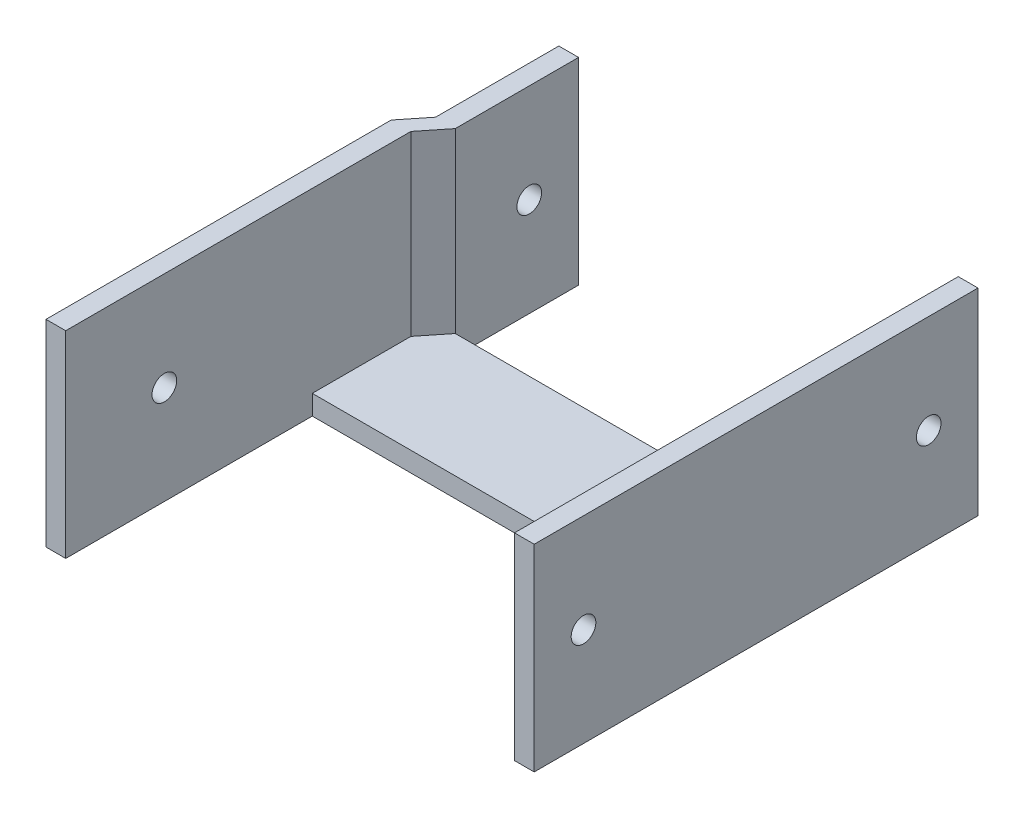
ISO-10303-21;
HEADER;
FILE_DESCRIPTION(('STEP AP214'),'2;1');
FILE_NAME('part.step','',(''),(''),'','','');
FILE_SCHEMA(('AUTOMOTIVE_DESIGN { 1 0 10303 214 1 1 1 1 }'));
ENDSEC;
DATA;
#1=APPLICATION_CONTEXT('core data for automotive mechanical design processes');
#2=APPLICATION_PROTOCOL_DEFINITION('international standard','automotive_design',2000,#1);
#3=PRODUCT_CONTEXT('',#1,'mechanical');
#4=PRODUCT('Part','Part','',(#3));
#5=PRODUCT_RELATED_PRODUCT_CATEGORY('part','',(#4));
#6=PRODUCT_DEFINITION_FORMATION('','',#4);
#7=PRODUCT_DEFINITION_CONTEXT('part definition',#1,'design');
#8=PRODUCT_DEFINITION('design','',#6,#7);
#9=PRODUCT_DEFINITION_SHAPE('','',#8);
#10=(LENGTH_UNIT() NAMED_UNIT(*) SI_UNIT(.MILLI.,.METRE.));
#11=(NAMED_UNIT(*) PLANE_ANGLE_UNIT() SI_UNIT($,.RADIAN.));
#12=(NAMED_UNIT(*) SI_UNIT($,.STERADIAN.) SOLID_ANGLE_UNIT());
#13=UNCERTAINTY_MEASURE_WITH_UNIT(LENGTH_MEASURE(1.E-05),#10,'distance_accuracy_value','');
#14=(GEOMETRIC_REPRESENTATION_CONTEXT(3) GLOBAL_UNCERTAINTY_ASSIGNED_CONTEXT((#13)) GLOBAL_UNIT_ASSIGNED_CONTEXT((#10,
#11,#12)) REPRESENTATION_CONTEXT('',''));
#15=CARTESIAN_POINT('',(0.,0.,0.));
#16=DIRECTION('',(0.,0.,1.));
#17=DIRECTION('',(1.,0.,0.));
#18=AXIS2_PLACEMENT_3D('',#15,#16,#17);
#19=CARTESIAN_POINT('',(-37.981426306344,-30.,0.));
#20=DIRECTION('',(-1.,0.,0.));
#21=DIRECTION('',(0.,0.,1.));
#22=AXIS2_PLACEMENT_3D('',#19,#20,#21);
#23=PLANE('',#22);
#24=DIRECTION('',(0.,1.,0.));
#25=VECTOR('',#24,1.);
#26=CARTESIAN_POINT('',(-37.981426306344,40.,4.99999999999999));
#27=LINE('',#26,#25);
#28=CARTESIAN_POINT('',(-37.981426306344,0.,4.99999999999999));
#29=VERTEX_POINT('',#28);
#30=CARTESIAN_POINT('',(-37.981426306344,40.,4.99999999999999));
#31=VERTEX_POINT('',#30);
#32=EDGE_CURVE('E150',#29,#31,#27,.T.);
#33=ORIENTED_EDGE('',*,*,#32,.F.);
#34=DIRECTION('',(0.,0.,1.));
#35=VECTOR('',#34,1.);
#36=CARTESIAN_POINT('',(-37.981426306344,0.,105.));
#37=LINE('',#36,#35);
#38=CARTESIAN_POINT('',(-37.981426306344,0.,30.));
#39=VERTEX_POINT('',#38);
#40=EDGE_CURVE('E159',#29,#39,#37,.T.);
#41=ORIENTED_EDGE('',*,*,#40,.T.);
#42=DIRECTION('',(0.,1.,0.));
#43=VECTOR('',#42,1.);
#44=CARTESIAN_POINT('',(-37.981426306344,-30.,30.));
#45=LINE('',#44,#43);
#46=CARTESIAN_POINT('',(-37.981426306344,40.,30.));
#47=VERTEX_POINT('',#46);
#48=EDGE_CURVE('E186',#39,#47,#45,.T.);
#49=ORIENTED_EDGE('',*,*,#48,.T.);
#50=DIRECTION('',(0.,0.,1.));
#51=VECTOR('',#50,1.);
#52=CARTESIAN_POINT('',(-37.981426306344,40.,0.));
#53=LINE('',#52,#51);
#54=EDGE_CURVE('E161',#31,#47,#53,.T.);
#55=ORIENTED_EDGE('',*,*,#54,.F.);
#56=EDGE_LOOP('',(#33,#41,#49,#55));
#57=FACE_BOUND('',#56,.T.);
#58=CARTESIAN_POINT('',(-37.981426306344,20.,15.));
#59=DIRECTION('',(-1.,0.,0.));
#60=DIRECTION('',(0.,0.,1.));
#61=AXIS2_PLACEMENT_3D('',#58,#59,#60);
#62=CIRCLE('',#61,2.5);
#63=CARTESIAN_POINT('',(-37.981426306344,20.,17.5));
#64=VERTEX_POINT('',#63);
#65=EDGE_CURVE('E337',#64,#64,#62,.T.);
#66=ORIENTED_EDGE('',*,*,#65,.F.);
#67=EDGE_LOOP('',(#66));
#68=FACE_BOUND('',#67,.T.);
#69=ADVANCED_FACE('F41',(#57,#68),#23,.T.);
#70=CARTESIAN_POINT('',(-33.981426306344,40.,30.));
#71=DIRECTION('',(-1.,0.,0.));
#72=DIRECTION('',(0.,0.,1.));
#73=AXIS2_PLACEMENT_3D('',#70,#71,#72);
#74=PLANE('',#73);
#75=CARTESIAN_POINT('',(-33.981426306344,20.,15.));
#76=DIRECTION('',(-1.,0.,0.));
#77=DIRECTION('',(0.,0.,1.));
#78=AXIS2_PLACEMENT_3D('',#75,#76,#77);
#79=CIRCLE('',#78,2.5);
#80=CARTESIAN_POINT('',(-33.981426306344,20.,17.5));
#81=VERTEX_POINT('',#80);
#82=EDGE_CURVE('E343',#81,#81,#79,.T.);
#83=ORIENTED_EDGE('',*,*,#82,.T.);
#84=EDGE_LOOP('',(#83));
#85=FACE_BOUND('',#84,.T.);
#86=DIRECTION('',(0.,0.,1.));
#87=VECTOR('',#86,1.);
#88=CARTESIAN_POINT('',(-33.981426306344,0.,105.));
#89=LINE('',#88,#87);
#90=CARTESIAN_POINT('',(-33.981426306344,0.,4.99999999999999));
#91=VERTEX_POINT('',#90);
#92=CARTESIAN_POINT('',(-33.981426306344,0.,30.));
#93=VERTEX_POINT('',#92);
#94=EDGE_CURVE('E267',#91,#93,#89,.T.);
#95=ORIENTED_EDGE('',*,*,#94,.F.);
#96=DIRECTION('',(0.,1.,0.));
#97=VECTOR('',#96,1.);
#98=CARTESIAN_POINT('',(-33.981426306344,40.,4.99999999999999));
#99=LINE('',#98,#97);
#100=CARTESIAN_POINT('',(-33.981426306344,40.,4.99999999999999));
#101=VERTEX_POINT('',#100);
#102=EDGE_CURVE('E56',#91,#101,#99,.T.);
#103=ORIENTED_EDGE('',*,*,#102,.T.);
#104=DIRECTION('',(0.,0.,-1.));
#105=VECTOR('',#104,1.);
#106=CARTESIAN_POINT('',(-33.981426306344,40.,30.));
#107=LINE('',#106,#105);
#108=CARTESIAN_POINT('',(-33.981426306344,40.,30.));
#109=VERTEX_POINT('',#108);
#110=EDGE_CURVE('E207',#109,#101,#107,.T.);
#111=ORIENTED_EDGE('',*,*,#110,.F.);
#112=DIRECTION('',(0.,1.,0.));
#113=VECTOR('',#112,1.);
#114=CARTESIAN_POINT('',(-33.981426306344,40.,30.));
#115=LINE('',#114,#113);
#116=CARTESIAN_POINT('',(-33.981426306344,4.,30.));
#117=VERTEX_POINT('',#116);
#118=EDGE_CURVE('E203',#117,#109,#115,.T.);
#119=ORIENTED_EDGE('',*,*,#118,.F.);
#120=DIRECTION('',(0.,1.,0.));
#121=VECTOR('',#120,1.);
#122=CARTESIAN_POINT('',(-33.981426306344,-26.,30.));
#123=LINE('',#122,#121);
#124=EDGE_CURVE('E254',#93,#117,#123,.T.);
#125=ORIENTED_EDGE('',*,*,#124,.F.);
#126=EDGE_LOOP('',(#95,#103,#111,#119,#125));
#127=FACE_BOUND('',#126,.T.);
#128=ADVANCED_FACE('F377',(#85,#127),#74,.F.);
#129=CARTESIAN_POINT('',(0.,40.,105.));
#130=DIRECTION('',(0.,1.,0.));
#131=DIRECTION('',(0.,0.,1.));
#132=AXIS2_PLACEMENT_3D('',#129,#130,#131);
#133=PLANE('',#132);
#134=DIRECTION('',(-1.,0.,0.));
#135=VECTOR('',#134,1.);
#136=CARTESIAN_POINT('',(-27.981426306344,40.,4.99999999999999));
#137=LINE('',#136,#135);
#138=EDGE_CURVE('E163',#101,#31,#137,.T.);
#139=ORIENTED_EDGE('',*,*,#138,.T.);
#140=ORIENTED_EDGE('',*,*,#54,.T.);
#141=DIRECTION('',(0.624695047554425,0.,-0.78086880944303));
#142=VECTOR('',#141,1.);
#143=CARTESIAN_POINT('',(-8.52525994289262,40.,-6.82020795431412));
#144=LINE('',#143,#142);
#145=CARTESIAN_POINT('',(-41.981426306344,40.,35.));
#146=VERTEX_POINT('',#145);
#147=EDGE_CURVE('E175',#146,#47,#144,.T.);
#148=ORIENTED_EDGE('',*,*,#147,.F.);
#149=DIRECTION('',(0.,0.,-1.));
#150=VECTOR('',#149,1.);
#151=CARTESIAN_POINT('',(-41.981426306344,40.,105.));
#152=LINE('',#151,#150);
#153=CARTESIAN_POINT('',(-41.981426306344,40.,105.));
#154=VERTEX_POINT('',#153);
#155=EDGE_CURVE('E245',#154,#146,#152,.T.);
#156=ORIENTED_EDGE('',*,*,#155,.F.);
#157=DIRECTION('',(1.,0.,0.));
#158=VECTOR('',#157,1.);
#159=CARTESIAN_POINT('',(0.,40.,105.));
#160=LINE('',#159,#158);
#161=CARTESIAN_POINT('',(-37.981426306344,40.,105.));
#162=VERTEX_POINT('',#161);
#163=EDGE_CURVE('E244',#154,#162,#160,.T.);
#164=ORIENTED_EDGE('',*,*,#163,.T.);
#165=DIRECTION('',(0.,0.,-1.));
#166=VECTOR('',#165,1.);
#167=CARTESIAN_POINT('',(-37.981426306344,40.,105.));
#168=LINE('',#167,#166);
#169=CARTESIAN_POINT('',(-37.981426306344,40.,35.));
#170=VERTEX_POINT('',#169);
#171=EDGE_CURVE('E240',#162,#170,#168,.T.);
#172=ORIENTED_EDGE('',*,*,#171,.T.);
#173=DIRECTION('',(0.624695047554424,0.,-0.78086880944303));
#174=VECTOR('',#173,1.);
#175=CARTESIAN_POINT('',(-33.981426306344,40.,30.));
#176=LINE('',#175,#174);
#177=EDGE_CURVE('E193',#170,#109,#176,.T.);
#178=ORIENTED_EDGE('',*,*,#177,.T.);
#179=ORIENTED_EDGE('',*,*,#110,.T.);
#180=EDGE_LOOP('',(#139,#140,#148,#156,#164,#172,#178,#179));
#181=FACE_BOUND('',#180,.T.);
#182=ADVANCED_FACE('F43',(#181),#133,.T.);
#183=CARTESIAN_POINT('',(-33.981426306344,0.,30.));
#184=DIRECTION('',(0.78086880944303,0.,0.624695047554424));
#185=DIRECTION('',(0.624695047554424,0.,-0.78086880944303));
#186=AXIS2_PLACEMENT_3D('',#183,#184,#185);
#187=PLANE('',#186);
#188=DIRECTION('',(-0.624695047554424,0.,0.78086880944303));
#189=VECTOR('',#188,1.);
#190=CARTESIAN_POINT('',(-33.981426306344,4.,30.));
#191=LINE('',#190,#189);
#192=CARTESIAN_POINT('',(-37.981426306344,4.,35.0000000000001));
#193=VERTEX_POINT('',#192);
#194=EDGE_CURVE('E50',#117,#193,#191,.T.);
#195=ORIENTED_EDGE('',*,*,#194,.F.);
#196=ORIENTED_EDGE('',*,*,#118,.T.);
#197=ORIENTED_EDGE('',*,*,#177,.F.);
#198=DIRECTION('',(0.,1.,0.));
#199=VECTOR('',#198,1.);
#200=CARTESIAN_POINT('',(-37.981426306344,0.,35.));
#201=LINE('',#200,#199);
#202=EDGE_CURVE('E197',#193,#170,#201,.T.);
#203=ORIENTED_EDGE('',*,*,#202,.F.);
#204=EDGE_LOOP('',(#195,#196,#197,#203));
#205=FACE_BOUND('',#204,.T.);
#206=ADVANCED_FACE('F402',(#205),#187,.T.);
#207=CARTESIAN_POINT('',(0.,0.,105.));
#208=DIRECTION('',(0.,0.,1.));
#209=DIRECTION('',(1.,0.,0.));
#210=AXIS2_PLACEMENT_3D('',#207,#208,#209);
#211=PLANE('',#210);
#212=DIRECTION('',(1.,0.,0.));
#213=VECTOR('',#212,1.);
#214=CARTESIAN_POINT('',(0.,0.,105.));
#215=LINE('',#214,#213);
#216=CARTESIAN_POINT('',(-41.981426306344,0.,105.));
#217=VERTEX_POINT('',#216);
#218=CARTESIAN_POINT('',(-37.981426306344,0.,105.));
#219=VERTEX_POINT('',#218);
#220=EDGE_CURVE('E183',#217,#219,#215,.T.);
#221=ORIENTED_EDGE('',*,*,#220,.T.);
#222=DIRECTION('',(0.,-1.,0.));
#223=VECTOR('',#222,1.);
#224=CARTESIAN_POINT('',(-37.981426306344,0.,105.));
#225=LINE('',#224,#223);
#226=EDGE_CURVE('E189',#162,#219,#225,.T.);
#227=ORIENTED_EDGE('',*,*,#226,.F.);
#228=ORIENTED_EDGE('',*,*,#163,.F.);
#229=DIRECTION('',(0.,1.,0.));
#230=VECTOR('',#229,1.);
#231=CARTESIAN_POINT('',(-41.981426306344,0.,105.));
#232=LINE('',#231,#230);
#233=EDGE_CURVE('E243',#217,#154,#232,.T.);
#234=ORIENTED_EDGE('',*,*,#233,.F.);
#235=EDGE_LOOP('',(#221,#227,#228,#234));
#236=FACE_BOUND('',#235,.T.);
#237=ADVANCED_FACE('F405',(#236),#211,.T.);
#238=CARTESIAN_POINT('',(-37.981426306344,0.,105.));
#239=DIRECTION('',(1.,0.,0.));
#240=DIRECTION('',(0.,1.,0.));
#241=AXIS2_PLACEMENT_3D('',#238,#239,#240);
#242=PLANE('',#241);
#243=CARTESIAN_POINT('',(-37.981426306344,20.,85.));
#244=DIRECTION('',(1.,0.,0.));
#245=DIRECTION('',(0.,1.,0.));
#246=AXIS2_PLACEMENT_3D('',#243,#244,#245);
#247=CIRCLE('',#246,2.5);
#248=CARTESIAN_POINT('',(-37.981426306344,22.5,85.));
#249=VERTEX_POINT('',#248);
#250=EDGE_CURVE('E351',#249,#249,#247,.T.);
#251=ORIENTED_EDGE('',*,*,#250,.F.);
#252=EDGE_LOOP('',(#251));
#253=FACE_BOUND('',#252,.T.);
#254=DIRECTION('',(0.,0.,-1.));
#255=VECTOR('',#254,1.);
#256=CARTESIAN_POINT('',(-37.981426306344,4.,105.));
#257=LINE('',#256,#255);
#258=CARTESIAN_POINT('',(-37.981426306344,4.,55.));
#259=VERTEX_POINT('',#258);
#260=EDGE_CURVE('E219',#259,#193,#257,.T.);
#261=ORIENTED_EDGE('',*,*,#260,.T.);
#262=ORIENTED_EDGE('',*,*,#202,.T.);
#263=ORIENTED_EDGE('',*,*,#171,.F.);
#264=ORIENTED_EDGE('',*,*,#226,.T.);
#265=DIRECTION('',(0.,0.,1.));
#266=VECTOR('',#265,1.);
#267=CARTESIAN_POINT('',(-37.981426306344,0.,105.));
#268=LINE('',#267,#266);
#269=CARTESIAN_POINT('',(-37.981426306344,0.,55.));
#270=VERTEX_POINT('',#269);
#271=EDGE_CURVE('E252',#270,#219,#268,.T.);
#272=ORIENTED_EDGE('',*,*,#271,.F.);
#273=DIRECTION('',(0.,1.,0.));
#274=VECTOR('',#273,1.);
#275=CARTESIAN_POINT('',(-37.981426306344,-26.,55.));
#276=LINE('',#275,#274);
#277=EDGE_CURVE('E228',#270,#259,#276,.T.);
#278=ORIENTED_EDGE('',*,*,#277,.T.);
#279=EDGE_LOOP('',(#261,#262,#263,#264,#272,#278));
#280=FACE_BOUND('',#279,.T.);
#281=ADVANCED_FACE('F225',(#253,#280),#242,.T.);
#282=CARTESIAN_POINT('',(0.,40.,105.));
#283=DIRECTION('',(0.,-1.,0.));
#284=DIRECTION('',(0.,0.,-1.));
#285=AXIS2_PLACEMENT_3D('',#282,#283,#284);
#286=PLANE('',#285);
#287=DIRECTION('',(0.,0.,-1.));
#288=VECTOR('',#287,1.);
#289=CARTESIAN_POINT('',(43.018573693656,40.,105.));
#290=LINE('',#289,#288);
#291=CARTESIAN_POINT('',(43.018573693656,40.,95.));
#292=VERTEX_POINT('',#291);
#293=CARTESIAN_POINT('',(43.018573693656,40.,4.99999999999999));
#294=VERTEX_POINT('',#293);
#295=EDGE_CURVE('E282',#292,#294,#290,.T.);
#296=ORIENTED_EDGE('',*,*,#295,.F.);
#297=DIRECTION('',(1.,0.,0.));
#298=VECTOR('',#297,1.);
#299=CARTESIAN_POINT('',(43.018573693656,40.,95.));
#300=LINE('',#299,#298);
#301=CARTESIAN_POINT('',(47.018573693656,40.,95.));
#302=VERTEX_POINT('',#301);
#303=EDGE_CURVE('E325',#292,#302,#300,.T.);
#304=ORIENTED_EDGE('',*,*,#303,.T.);
#305=DIRECTION('',(0.,0.,-1.));
#306=VECTOR('',#305,1.);
#307=CARTESIAN_POINT('',(47.018573693656,40.,105.));
#308=LINE('',#307,#306);
#309=CARTESIAN_POINT('',(47.018573693656,40.,4.99999999999999));
#310=VERTEX_POINT('',#309);
#311=EDGE_CURVE('E230',#302,#310,#308,.T.);
#312=ORIENTED_EDGE('',*,*,#311,.T.);
#313=DIRECTION('',(1.,0.,0.));
#314=VECTOR('',#313,1.);
#315=CARTESIAN_POINT('',(43.018573693656,40.,4.99999999999999));
#316=LINE('',#315,#314);
#317=EDGE_CURVE('E313',#294,#310,#316,.T.);
#318=ORIENTED_EDGE('',*,*,#317,.F.);
#319=EDGE_LOOP('',(#296,#304,#312,#318));
#320=FACE_BOUND('',#319,.T.);
#321=ADVANCED_FACE('F423',(#320),#286,.F.);
#322=CARTESIAN_POINT('',(43.018573693656,0.,105.));
#323=DIRECTION('',(1.,0.,0.));
#324=DIRECTION('',(0.,1.,0.));
#325=AXIS2_PLACEMENT_3D('',#322,#323,#324);
#326=PLANE('',#325);
#327=CARTESIAN_POINT('',(43.018573693656,20.,15.));
#328=DIRECTION('',(1.,0.,0.));
#329=DIRECTION('',(0.,1.,0.));
#330=AXIS2_PLACEMENT_3D('',#327,#328,#329);
#331=CIRCLE('',#330,2.5);
#332=CARTESIAN_POINT('',(43.018573693656,22.5,15.));
#333=VERTEX_POINT('',#332);
#334=EDGE_CURVE('E347',#333,#333,#331,.T.);
#335=ORIENTED_EDGE('',*,*,#334,.T.);
#336=EDGE_LOOP('',(#335));
#337=FACE_BOUND('',#336,.T.);
#338=CARTESIAN_POINT('',(43.018573693656,20.,85.));
#339=DIRECTION('',(1.,0.,0.));
#340=DIRECTION('',(0.,1.,0.));
#341=AXIS2_PLACEMENT_3D('',#338,#339,#340);
#342=CIRCLE('',#341,2.5);
#343=CARTESIAN_POINT('',(43.018573693656,22.5,85.));
#344=VERTEX_POINT('',#343);
#345=EDGE_CURVE('E355',#344,#344,#342,.T.);
#346=ORIENTED_EDGE('',*,*,#345,.T.);
#347=EDGE_LOOP('',(#346));
#348=FACE_BOUND('',#347,.T.);
#349=DIRECTION('',(0.,0.,-1.));
#350=VECTOR('',#349,1.);
#351=CARTESIAN_POINT('',(43.018573693656,0.,105.));
#352=LINE('',#351,#350);
#353=CARTESIAN_POINT('',(43.018573693656,0.,95.));
#354=VERTEX_POINT('',#353);
#355=CARTESIAN_POINT('',(43.018573693656,0.,55.));
#356=VERTEX_POINT('',#355);
#357=EDGE_CURVE('E276',#354,#356,#352,.T.);
#358=ORIENTED_EDGE('',*,*,#357,.F.);
#359=DIRECTION('',(0.,1.,0.));
#360=VECTOR('',#359,1.);
#361=CARTESIAN_POINT('',(43.018573693656,0.,95.));
#362=LINE('',#361,#360);
#363=EDGE_CURVE('E64',#354,#292,#362,.T.);
#364=ORIENTED_EDGE('',*,*,#363,.T.);
#365=ORIENTED_EDGE('',*,*,#295,.T.);
#366=DIRECTION('',(0.,-1.,0.));
#367=VECTOR('',#366,1.);
#368=CARTESIAN_POINT('',(43.018573693656,40.,4.99999999999999));
#369=LINE('',#368,#367);
#370=CARTESIAN_POINT('',(43.018573693656,0.,4.99999999999999));
#371=VERTEX_POINT('',#370);
#372=EDGE_CURVE('E317',#294,#371,#369,.T.);
#373=ORIENTED_EDGE('',*,*,#372,.T.);
#374=DIRECTION('',(0.,0.,-1.));
#375=VECTOR('',#374,1.);
#376=CARTESIAN_POINT('',(43.018573693656,0.,105.));
#377=LINE('',#376,#375);
#378=CARTESIAN_POINT('',(43.018573693656,0.,30.));
#379=VERTEX_POINT('',#378);
#380=EDGE_CURVE('E272',#379,#371,#377,.T.);
#381=ORIENTED_EDGE('',*,*,#380,.F.);
#382=DIRECTION('',(0.,1.,0.));
#383=VECTOR('',#382,1.);
#384=CARTESIAN_POINT('',(43.018573693656,-26.,30.));
#385=LINE('',#384,#383);
#386=CARTESIAN_POINT('',(43.018573693656,3.99999999999999,30.));
#387=VERTEX_POINT('',#386);
#388=EDGE_CURVE('E234',#379,#387,#385,.T.);
#389=ORIENTED_EDGE('',*,*,#388,.T.);
#390=DIRECTION('',(0.,0.,-1.));
#391=VECTOR('',#390,1.);
#392=CARTESIAN_POINT('',(43.018573693656,4.,105.));
#393=LINE('',#392,#391);
#394=CARTESIAN_POINT('',(43.018573693656,3.99999999999999,55.));
#395=VERTEX_POINT('',#394);
#396=EDGE_CURVE('E238',#395,#387,#393,.T.);
#397=ORIENTED_EDGE('',*,*,#396,.F.);
#398=DIRECTION('',(0.,1.,0.));
#399=VECTOR('',#398,1.);
#400=CARTESIAN_POINT('',(43.018573693656,-26.,55.));
#401=LINE('',#400,#399);
#402=EDGE_CURVE('E178',#356,#395,#401,.T.);
#403=ORIENTED_EDGE('',*,*,#402,.F.);
#404=EDGE_LOOP('',(#358,#364,#365,#373,#381,#389,#397,#403));
#405=FACE_BOUND('',#404,.T.);
#406=ADVANCED_FACE('F300',(#337,#348,#405),#326,.F.);
#407=CARTESIAN_POINT('',(0.,4.,105.));
#408=DIRECTION('',(0.,1.,0.));
#409=DIRECTION('',(0.,0.,1.));
#410=AXIS2_PLACEMENT_3D('',#407,#408,#409);
#411=PLANE('',#410);
#412=DIRECTION('',(1.,0.,0.));
#413=VECTOR('',#412,1.);
#414=CARTESIAN_POINT('',(-33.981426306344,4.,30.));
#415=LINE('',#414,#413);
#416=EDGE_CURVE('E221',#117,#387,#415,.T.);
#417=ORIENTED_EDGE('',*,*,#416,.F.);
#418=ORIENTED_EDGE('',*,*,#194,.T.);
#419=ORIENTED_EDGE('',*,*,#260,.F.);
#420=DIRECTION('',(-1.,0.,0.));
#421=VECTOR('',#420,1.);
#422=CARTESIAN_POINT('',(-37.981426306344,4.,55.));
#423=LINE('',#422,#421);
#424=EDGE_CURVE('E171',#395,#259,#423,.T.);
#425=ORIENTED_EDGE('',*,*,#424,.F.);
#426=ORIENTED_EDGE('',*,*,#396,.T.);
#427=EDGE_LOOP('',(#417,#418,#419,#425,#426));
#428=FACE_BOUND('',#427,.T.);
#429=ADVANCED_FACE('F217',(#428),#411,.T.);
#430=CARTESIAN_POINT('',(-41.981426306344,0.,105.));
#431=DIRECTION('',(-1.,0.,0.));
#432=DIRECTION('',(0.,0.,1.));
#433=AXIS2_PLACEMENT_3D('',#430,#431,#432);
#434=PLANE('',#433);
#435=CARTESIAN_POINT('',(-41.981426306344,20.,85.));
#436=DIRECTION('',(1.,0.,0.));
#437=DIRECTION('',(0.,0.,-1.));
#438=AXIS2_PLACEMENT_3D('',#435,#436,#437);
#439=CIRCLE('',#438,2.5);
#440=CARTESIAN_POINT('',(-41.981426306344,20.,82.5));
#441=VERTEX_POINT('',#440);
#442=EDGE_CURVE('E364',#441,#441,#439,.T.);
#443=ORIENTED_EDGE('',*,*,#442,.T.);
#444=EDGE_LOOP('',(#443));
#445=FACE_BOUND('',#444,.T.);
#446=DIRECTION('',(0.,1.,0.));
#447=VECTOR('',#446,1.);
#448=CARTESIAN_POINT('',(-41.981426306344,-30.,35.));
#449=LINE('',#448,#447);
#450=CARTESIAN_POINT('',(-41.981426306344,0.,35.));
#451=VERTEX_POINT('',#450);
#452=EDGE_CURVE('E170',#451,#146,#449,.T.);
#453=ORIENTED_EDGE('',*,*,#452,.F.);
#454=DIRECTION('',(0.,0.,-1.));
#455=VECTOR('',#454,1.);
#456=CARTESIAN_POINT('',(-41.981426306344,0.,105.));
#457=LINE('',#456,#455);
#458=EDGE_CURVE('E184',#217,#451,#457,.T.);
#459=ORIENTED_EDGE('',*,*,#458,.F.);
#460=ORIENTED_EDGE('',*,*,#233,.T.);
#461=ORIENTED_EDGE('',*,*,#155,.T.);
#462=EDGE_LOOP('',(#453,#459,#460,#461));
#463=FACE_BOUND('',#462,.T.);
#464=ADVANCED_FACE('F391',(#445,#463),#434,.T.);
#465=CARTESIAN_POINT('',(47.018573693656,0.,105.));
#466=DIRECTION('',(-1.,0.,0.));
#467=DIRECTION('',(0.,0.,1.));
#468=AXIS2_PLACEMENT_3D('',#465,#466,#467);
#469=PLANE('',#468);
#470=CARTESIAN_POINT('',(47.018573693656,20.,15.));
#471=DIRECTION('',(1.,0.,0.));
#472=DIRECTION('',(0.,0.,-1.));
#473=AXIS2_PLACEMENT_3D('',#470,#471,#472);
#474=CIRCLE('',#473,2.5);
#475=CARTESIAN_POINT('',(47.018573693656,20.,12.5));
#476=VERTEX_POINT('',#475);
#477=EDGE_CURVE('E359',#476,#476,#474,.T.);
#478=ORIENTED_EDGE('',*,*,#477,.F.);
#479=EDGE_LOOP('',(#478));
#480=FACE_BOUND('',#479,.T.);
#481=CARTESIAN_POINT('',(47.018573693656,20.,85.));
#482=DIRECTION('',(1.,0.,0.));
#483=DIRECTION('',(0.,0.,-1.));
#484=AXIS2_PLACEMENT_3D('',#481,#482,#483);
#485=CIRCLE('',#484,2.5);
#486=CARTESIAN_POINT('',(47.018573693656,20.,82.5));
#487=VERTEX_POINT('',#486);
#488=EDGE_CURVE('E360',#487,#487,#485,.T.);
#489=ORIENTED_EDGE('',*,*,#488,.F.);
#490=EDGE_LOOP('',(#489));
#491=FACE_BOUND('',#490,.T.);
#492=ORIENTED_EDGE('',*,*,#311,.F.);
#493=DIRECTION('',(0.,1.,0.));
#494=VECTOR('',#493,1.);
#495=CARTESIAN_POINT('',(47.018573693656,0.,95.));
#496=LINE('',#495,#494);
#497=CARTESIAN_POINT('',(47.018573693656,0.,95.));
#498=VERTEX_POINT('',#497);
#499=EDGE_CURVE('E334',#498,#302,#496,.T.);
#500=ORIENTED_EDGE('',*,*,#499,.F.);
#501=DIRECTION('',(0.,0.,-1.));
#502=VECTOR('',#501,1.);
#503=CARTESIAN_POINT('',(47.018573693656,0.,105.));
#504=LINE('',#503,#502);
#505=CARTESIAN_POINT('',(47.018573693656,0.,4.99999999999999));
#506=VERTEX_POINT('',#505);
#507=EDGE_CURVE('E249',#498,#506,#504,.T.);
#508=ORIENTED_EDGE('',*,*,#507,.T.);
#509=DIRECTION('',(0.,-1.,0.));
#510=VECTOR('',#509,1.);
#511=CARTESIAN_POINT('',(47.018573693656,40.,4.99999999999999));
#512=LINE('',#511,#510);
#513=EDGE_CURVE('E321',#310,#506,#512,.T.);
#514=ORIENTED_EDGE('',*,*,#513,.F.);
#515=EDGE_LOOP('',(#492,#500,#508,#514));
#516=FACE_BOUND('',#515,.T.);
#517=ADVANCED_FACE('F383',(#480,#491,#516),#469,.F.);
#518=CARTESIAN_POINT('',(-33.981426306344,-26.,30.));
#519=DIRECTION('',(0.,0.,1.));
#520=DIRECTION('',(1.,0.,0.));
#521=AXIS2_PLACEMENT_3D('',#518,#519,#520);
#522=PLANE('',#521);
#523=ORIENTED_EDGE('',*,*,#124,.T.);
#524=ORIENTED_EDGE('',*,*,#416,.T.);
#525=ORIENTED_EDGE('',*,*,#388,.F.);
#526=DIRECTION('',(1.,0.,0.));
#527=VECTOR('',#526,1.);
#528=CARTESIAN_POINT('',(0.,0.,30.));
#529=LINE('',#528,#527);
#530=EDGE_CURVE('E270',#93,#379,#529,.T.);
#531=ORIENTED_EDGE('',*,*,#530,.F.);
#532=EDGE_LOOP('',(#523,#524,#525,#531));
#533=FACE_BOUND('',#532,.T.);
#534=ADVANCED_FACE('F381',(#533),#522,.F.);
#535=CARTESIAN_POINT('',(-37.981426306344,-26.,55.));
#536=DIRECTION('',(0.,0.,-1.));
#537=DIRECTION('',(-1.,0.,0.));
#538=AXIS2_PLACEMENT_3D('',#535,#536,#537);
#539=PLANE('',#538);
#540=ORIENTED_EDGE('',*,*,#402,.T.);
#541=ORIENTED_EDGE('',*,*,#424,.T.);
#542=ORIENTED_EDGE('',*,*,#277,.F.);
#543=DIRECTION('',(-1.,0.,0.));
#544=VECTOR('',#543,1.);
#545=CARTESIAN_POINT('',(0.,0.,55.));
#546=LINE('',#545,#544);
#547=EDGE_CURVE('E288',#356,#270,#546,.T.);
#548=ORIENTED_EDGE('',*,*,#547,.F.);
#549=EDGE_LOOP('',(#540,#541,#542,#548));
#550=FACE_BOUND('',#549,.T.);
#551=ADVANCED_FACE('F295',(#550),#539,.F.);
#552=CARTESIAN_POINT('',(-8.52525994289262,-30.,-6.82020795431412));
#553=DIRECTION('',(0.780868809443029,0.,0.624695047554425));
#554=DIRECTION('',(0.624695047554425,0.,-0.780868809443029));
#555=AXIS2_PLACEMENT_3D('',#552,#553,#554);
#556=PLANE('',#555);
#557=ORIENTED_EDGE('',*,*,#452,.T.);
#558=ORIENTED_EDGE('',*,*,#147,.T.);
#559=ORIENTED_EDGE('',*,*,#48,.F.);
#560=DIRECTION('',(0.624695047554425,0.,-0.780868809443029));
#561=VECTOR('',#560,1.);
#562=CARTESIAN_POINT('',(-59.7447721380146,0.,57.2041822895882));
#563=LINE('',#562,#561);
#564=EDGE_CURVE('E168',#451,#39,#563,.T.);
#565=ORIENTED_EDGE('',*,*,#564,.F.);
#566=EDGE_LOOP('',(#557,#558,#559,#565));
#567=FACE_BOUND('',#566,.T.);
#568=ADVANCED_FACE('F389',(#567),#556,.F.);
#569=CARTESIAN_POINT('',(0.,0.,0.));
#570=DIRECTION('',(0.,-1.,0.));
#571=DIRECTION('',(0.,0.,-1.));
#572=AXIS2_PLACEMENT_3D('',#569,#570,#571);
#573=PLANE('',#572);
#574=DIRECTION('',(-1.,0.,0.));
#575=VECTOR('',#574,1.);
#576=CARTESIAN_POINT('',(0.,0.,4.99999999999999));
#577=LINE('',#576,#575);
#578=EDGE_CURVE('E11',#91,#29,#577,.T.);
#579=ORIENTED_EDGE('',*,*,#578,.F.);
#580=ORIENTED_EDGE('',*,*,#94,.T.);
#581=ORIENTED_EDGE('',*,*,#530,.T.);
#582=ORIENTED_EDGE('',*,*,#380,.T.);
#583=DIRECTION('',(1.,0.,0.));
#584=VECTOR('',#583,1.);
#585=CARTESIAN_POINT('',(43.018573693656,0.,4.99999999999999));
#586=LINE('',#585,#584);
#587=EDGE_CURVE('E271',#371,#506,#586,.T.);
#588=ORIENTED_EDGE('',*,*,#587,.T.);
#589=ORIENTED_EDGE('',*,*,#507,.F.);
#590=DIRECTION('',(1.,0.,0.));
#591=VECTOR('',#590,1.);
#592=CARTESIAN_POINT('',(43.018573693656,0.,95.));
#593=LINE('',#592,#591);
#594=EDGE_CURVE('E328',#354,#498,#593,.T.);
#595=ORIENTED_EDGE('',*,*,#594,.F.);
#596=ORIENTED_EDGE('',*,*,#357,.T.);
#597=ORIENTED_EDGE('',*,*,#547,.T.);
#598=ORIENTED_EDGE('',*,*,#271,.T.);
#599=ORIENTED_EDGE('',*,*,#220,.F.);
#600=ORIENTED_EDGE('',*,*,#458,.T.);
#601=ORIENTED_EDGE('',*,*,#564,.T.);
#602=ORIENTED_EDGE('',*,*,#40,.F.);
#603=EDGE_LOOP('',(#579,#580,#581,#582,#588,#589,#595,#596,#597,#598,#599,#600,#601,#602));
#604=FACE_BOUND('',#603,.T.);
#605=ADVANCED_FACE('F166',(#604),#573,.T.);
#606=CARTESIAN_POINT('',(43.018573693656,40.,4.99999999999999));
#607=DIRECTION('',(0.,0.,1.));
#608=DIRECTION('',(0.,-1.,0.));
#609=AXIS2_PLACEMENT_3D('',#606,#607,#608);
#610=PLANE('',#609);
#611=ORIENTED_EDGE('',*,*,#513,.T.);
#612=ORIENTED_EDGE('',*,*,#587,.F.);
#613=ORIENTED_EDGE('',*,*,#372,.F.);
#614=ORIENTED_EDGE('',*,*,#317,.T.);
#615=EDGE_LOOP('',(#611,#612,#613,#614));
#616=FACE_BOUND('',#615,.T.);
#617=ADVANCED_FACE('F408',(#616),#610,.F.);
#618=CARTESIAN_POINT('',(43.018573693656,0.,95.));
#619=DIRECTION('',(0.,0.,-1.));
#620=DIRECTION('',(-1.,0.,0.));
#621=AXIS2_PLACEMENT_3D('',#618,#619,#620);
#622=PLANE('',#621);
#623=ORIENTED_EDGE('',*,*,#499,.T.);
#624=ORIENTED_EDGE('',*,*,#303,.F.);
#625=ORIENTED_EDGE('',*,*,#363,.F.);
#626=ORIENTED_EDGE('',*,*,#594,.T.);
#627=EDGE_LOOP('',(#623,#624,#625,#626));
#628=FACE_BOUND('',#627,.T.);
#629=ADVANCED_FACE('F429',(#628),#622,.F.);
#630=CARTESIAN_POINT('',(-41.981426306344,20.,85.));
#631=DIRECTION('',(1.,0.,0.));
#632=DIRECTION('',(0.,0.,-1.));
#633=AXIS2_PLACEMENT_3D('',#630,#631,#632);
#634=CYLINDRICAL_SURFACE('',#633,2.5);
#635=ORIENTED_EDGE('',*,*,#488,.T.);
#636=EDGE_LOOP('',(#635));
#637=FACE_BOUND('',#636,.T.);
#638=ORIENTED_EDGE('',*,*,#345,.F.);
#639=EDGE_LOOP('',(#638));
#640=FACE_BOUND('',#639,.T.);
#641=ADVANCED_FACE('F431',(#637,#640),#634,.F.);
#642=CARTESIAN_POINT('',(-41.981426306344,20.,15.));
#643=DIRECTION('',(1.,0.,0.));
#644=DIRECTION('',(0.,0.,-1.));
#645=AXIS2_PLACEMENT_3D('',#642,#643,#644);
#646=CYLINDRICAL_SURFACE('',#645,2.5);
#647=ORIENTED_EDGE('',*,*,#477,.T.);
#648=EDGE_LOOP('',(#647));
#649=FACE_BOUND('',#648,.T.);
#650=ORIENTED_EDGE('',*,*,#334,.F.);
#651=EDGE_LOOP('',(#650));
#652=FACE_BOUND('',#651,.T.);
#653=ADVANCED_FACE('F437',(#649,#652),#646,.F.);
#654=ORIENTED_EDGE('',*,*,#250,.T.);
#655=EDGE_LOOP('',(#654));
#656=FACE_BOUND('',#655,.T.);
#657=ORIENTED_EDGE('',*,*,#442,.F.);
#658=EDGE_LOOP('',(#657));
#659=FACE_BOUND('',#658,.T.);
#660=ADVANCED_FACE('F440',(#656,#659),#634,.F.);
#661=ORIENTED_EDGE('',*,*,#65,.T.);
#662=EDGE_LOOP('',(#661));
#663=FACE_BOUND('',#662,.T.);
#664=ORIENTED_EDGE('',*,*,#82,.F.);
#665=EDGE_LOOP('',(#664));
#666=FACE_BOUND('',#665,.T.);
#667=ADVANCED_FACE('F506',(#663,#666),#646,.F.);
#668=CARTESIAN_POINT('',(-27.981426306344,40.,4.99999999999999));
#669=DIRECTION('',(0.,0.,1.));
#670=DIRECTION('',(1.,0.,0.));
#671=AXIS2_PLACEMENT_3D('',#668,#669,#670);
#672=PLANE('',#671);
#673=ORIENTED_EDGE('',*,*,#578,.T.);
#674=ORIENTED_EDGE('',*,*,#32,.T.);
#675=ORIENTED_EDGE('',*,*,#138,.F.);
#676=ORIENTED_EDGE('',*,*,#102,.F.);
#677=EDGE_LOOP('',(#673,#674,#675,#676));
#678=FACE_BOUND('',#677,.T.);
#679=ADVANCED_FACE('F149',(#678),#672,.F.);
#680=CLOSED_SHELL('',(#69,#128,#182,#206,#237,#281,#321,#406,#429,#464,#517,#534,#551,#568,#605,
#617,#629,#641,#653,#660,#667,#679));
#681=MANIFOLD_SOLID_BREP('B2',#680);
#682=ADVANCED_BREP_SHAPE_REPRESENTATION('',(#18,#681),#14);
#683=SHAPE_DEFINITION_REPRESENTATION(#9,#682);
ENDSEC;
END-ISO-10303-21;
